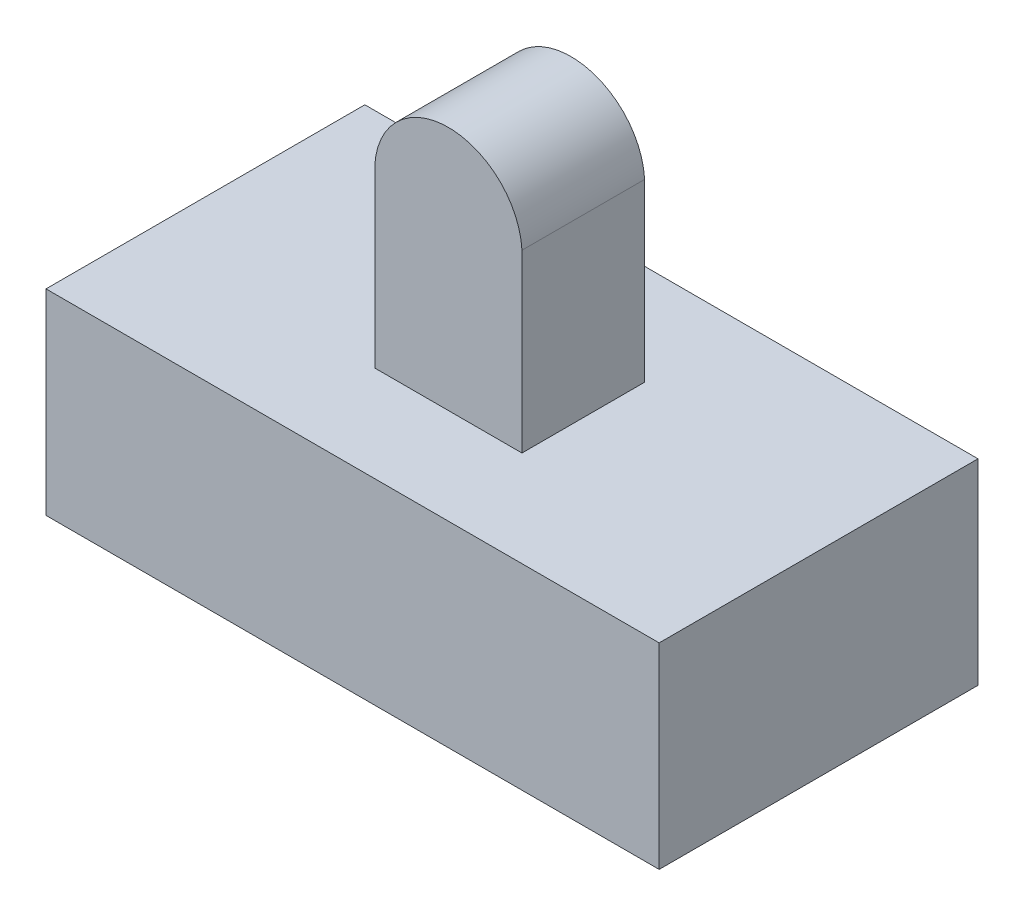
ISO-10303-21;
HEADER;
FILE_DESCRIPTION(('STEP AP214'),'2;1');
FILE_NAME('part.step','',(''),(''),'','','');
FILE_SCHEMA(('AUTOMOTIVE_DESIGN { 1 0 10303 214 1 1 1 1 }'));
ENDSEC;
DATA;
#1=APPLICATION_CONTEXT('core data for automotive mechanical design processes');
#2=APPLICATION_PROTOCOL_DEFINITION('international standard','automotive_design',2000,#1);
#3=PRODUCT_CONTEXT('',#1,'mechanical');
#4=PRODUCT('Part','Part','',(#3));
#5=PRODUCT_RELATED_PRODUCT_CATEGORY('part','',(#4));
#6=PRODUCT_DEFINITION_FORMATION('','',#4);
#7=PRODUCT_DEFINITION_CONTEXT('part definition',#1,'design');
#8=PRODUCT_DEFINITION('design','',#6,#7);
#9=PRODUCT_DEFINITION_SHAPE('','',#8);
#10=(LENGTH_UNIT() NAMED_UNIT(*) SI_UNIT(.MILLI.,.METRE.));
#11=(NAMED_UNIT(*) PLANE_ANGLE_UNIT() SI_UNIT($,.RADIAN.));
#12=(NAMED_UNIT(*) SI_UNIT($,.STERADIAN.) SOLID_ANGLE_UNIT());
#13=UNCERTAINTY_MEASURE_WITH_UNIT(LENGTH_MEASURE(1.E-05),#10,'distance_accuracy_value','');
#14=(GEOMETRIC_REPRESENTATION_CONTEXT(3) GLOBAL_UNCERTAINTY_ASSIGNED_CONTEXT((#13)) GLOBAL_UNIT_ASSIGNED_CONTEXT((#10,
#11,#12)) REPRESENTATION_CONTEXT('',''));
#15=CARTESIAN_POINT('',(0.,0.,0.));
#16=DIRECTION('',(0.,0.,1.));
#17=DIRECTION('',(1.,0.,0.));
#18=AXIS2_PLACEMENT_3D('',#15,#16,#17);
#19=CARTESIAN_POINT('',(9.67525773195877,18.,-0.59748188321778));
#20=DIRECTION('',(0.,0.,1.));
#21=DIRECTION('',(1.,0.,0.));
#22=AXIS2_PLACEMENT_3D('',#19,#20,#21);
#23=PLANE('',#22);
#24=CARTESIAN_POINT('',(6.67525773195877,14.9954138747722,-0.597481883217779));
#25=DIRECTION('',(0.,0.,-1.));
#26=DIRECTION('',(-1.,0.,0.));
#27=AXIS2_PLACEMENT_3D('',#24,#25,#26);
#28=CIRCLE('',#27,3.00458612522776);
#29=CARTESIAN_POINT('',(9.67525773195877,15.1613589979641,-0.59748188321778));
#30=VERTEX_POINT('',#29);
#31=CARTESIAN_POINT('',(3.67525773195877,15.1613589979641,-0.597481883217779));
#32=VERTEX_POINT('',#31);
#33=EDGE_CURVE('E150',#30,#32,#28,.F.);
#34=ORIENTED_EDGE('',*,*,#33,.F.);
#35=DIRECTION('',(0.,-1.,0.));
#36=VECTOR('',#35,1.);
#37=CARTESIAN_POINT('',(9.67525773195877,18.,-0.59748188321778));
#38=LINE('',#37,#36);
#39=CARTESIAN_POINT('',(9.67525773195877,8.,-0.59748188321778));
#40=VERTEX_POINT('',#39);
#41=EDGE_CURVE('E154',#30,#40,#38,.T.);
#42=ORIENTED_EDGE('',*,*,#41,.T.);
#43=DIRECTION('',(-1.,0.,0.));
#44=VECTOR('',#43,1.);
#45=CARTESIAN_POINT('',(9.67525773195877,8.,-0.59748188321778));
#46=LINE('',#45,#44);
#47=CARTESIAN_POINT('',(3.67525773195877,8.,-0.597481883217779));
#48=VERTEX_POINT('',#47);
#49=EDGE_CURVE('E431',#40,#48,#46,.T.);
#50=ORIENTED_EDGE('',*,*,#49,.T.);
#51=DIRECTION('',(0.,-1.,0.));
#52=VECTOR('',#51,1.);
#53=CARTESIAN_POINT('',(3.67525773195877,18.,-0.597481883217779));
#54=LINE('',#53,#52);
#55=EDGE_CURVE('E156',#32,#48,#54,.T.);
#56=ORIENTED_EDGE('',*,*,#55,.F.);
#57=EDGE_LOOP('',(#34,#42,#50,#56));
#58=FACE_BOUND('',#57,.T.);
#59=ADVANCED_FACE('F57',(#58),#23,.F.);
#60=CARTESIAN_POINT('',(9.67525773195877,18.,4.40251811678222));
#61=DIRECTION('',(0.,0.,-1.));
#62=DIRECTION('',(-1.,0.,0.));
#63=AXIS2_PLACEMENT_3D('',#60,#61,#62);
#64=PLANE('',#63);
#65=DIRECTION('',(0.,-1.,0.));
#66=VECTOR('',#65,1.);
#67=CARTESIAN_POINT('',(9.67525773195877,18.,4.40251811678222));
#68=LINE('',#67,#66);
#69=CARTESIAN_POINT('',(9.67525773195877,15.1613589979641,4.40251811678222));
#70=VERTEX_POINT('',#69);
#71=CARTESIAN_POINT('',(9.67525773195877,8.,4.40251811678222));
#72=VERTEX_POINT('',#71);
#73=EDGE_CURVE('E73',#70,#72,#68,.T.);
#74=ORIENTED_EDGE('',*,*,#73,.F.);
#75=CARTESIAN_POINT('',(6.67525773195877,14.9954138747722,4.40251811678222));
#76=DIRECTION('',(0.,0.,-1.));
#77=DIRECTION('',(-1.,0.,0.));
#78=AXIS2_PLACEMENT_3D('',#75,#76,#77);
#79=CIRCLE('',#78,3.00458612522776);
#80=CARTESIAN_POINT('',(3.67525773195877,15.1613589979641,4.40251811678222));
#81=VERTEX_POINT('',#80);
#82=EDGE_CURVE('E164',#70,#81,#79,.F.);
#83=ORIENTED_EDGE('',*,*,#82,.T.);
#84=DIRECTION('',(0.,-1.,0.));
#85=VECTOR('',#84,1.);
#86=CARTESIAN_POINT('',(3.67525773195877,18.,4.40251811678222));
#87=LINE('',#86,#85);
#88=CARTESIAN_POINT('',(3.67525773195877,8.,4.40251811678222));
#89=VERTEX_POINT('',#88);
#90=EDGE_CURVE('E81',#81,#89,#87,.T.);
#91=ORIENTED_EDGE('',*,*,#90,.T.);
#92=DIRECTION('',(1.,0.,0.));
#93=VECTOR('',#92,1.);
#94=CARTESIAN_POINT('',(9.67525773195877,8.,4.40251811678222));
#95=LINE('',#94,#93);
#96=EDGE_CURVE('E424',#89,#72,#95,.T.);
#97=ORIENTED_EDGE('',*,*,#96,.T.);
#98=EDGE_LOOP('',(#74,#83,#91,#97));
#99=FACE_BOUND('',#98,.T.);
#100=ADVANCED_FACE('F281',(#99),#64,.F.);
#101=CARTESIAN_POINT('',(-5.82474226804123,8.,-4.69072164948454));
#102=DIRECTION('',(1.,0.,0.));
#103=DIRECTION('',(0.,0.,-1.));
#104=AXIS2_PLACEMENT_3D('',#101,#102,#103);
#105=PLANE('',#104);
#106=DIRECTION('',(0.,0.,1.));
#107=VECTOR('',#106,1.);
#108=CARTESIAN_POINT('',(-5.82474226804123,0.,-4.69072164948454));
#109=LINE('',#108,#107);
#110=CARTESIAN_POINT('',(-5.82474226804123,0.,-4.69072164948454));
#111=VERTEX_POINT('',#110);
#112=CARTESIAN_POINT('',(-5.82474226804123,0.,8.30927835051546));
#113=VERTEX_POINT('',#112);
#114=EDGE_CURVE('E210',#111,#113,#109,.T.);
#115=ORIENTED_EDGE('',*,*,#114,.T.);
#116=DIRECTION('',(0.,-1.,0.));
#117=VECTOR('',#116,1.);
#118=CARTESIAN_POINT('',(-5.82474226804123,8.,8.30927835051546));
#119=LINE('',#118,#117);
#120=CARTESIAN_POINT('',(-5.82474226804123,8.,8.30927835051546));
#121=VERTEX_POINT('',#120);
#122=EDGE_CURVE('E12',#121,#113,#119,.T.);
#123=ORIENTED_EDGE('',*,*,#122,.F.);
#124=DIRECTION('',(0.,0.,1.));
#125=VECTOR('',#124,1.);
#126=CARTESIAN_POINT('',(-5.82474226804123,8.,-4.69072164948454));
#127=LINE('',#126,#125);
#128=CARTESIAN_POINT('',(-5.82474226804123,8.,-4.69072164948454));
#129=VERTEX_POINT('',#128);
#130=EDGE_CURVE('E220',#129,#121,#127,.T.);
#131=ORIENTED_EDGE('',*,*,#130,.F.);
#132=DIRECTION('',(0.,-1.,0.));
#133=VECTOR('',#132,1.);
#134=CARTESIAN_POINT('',(-5.82474226804123,8.,-4.69072164948454));
#135=LINE('',#134,#133);
#136=EDGE_CURVE('E234',#129,#111,#135,.T.);
#137=ORIENTED_EDGE('',*,*,#136,.T.);
#138=EDGE_LOOP('',(#115,#123,#131,#137));
#139=FACE_BOUND('',#138,.T.);
#140=ADVANCED_FACE('F59',(#139),#105,.F.);
#141=CARTESIAN_POINT('',(-5.82474226804123,8.,8.30927835051546));
#142=DIRECTION('',(0.,0.,-1.));
#143=DIRECTION('',(-1.,0.,0.));
#144=AXIS2_PLACEMENT_3D('',#141,#142,#143);
#145=PLANE('',#144);
#146=DIRECTION('',(1.,0.,0.));
#147=VECTOR('',#146,1.);
#148=CARTESIAN_POINT('',(-5.82474226804123,0.,8.30927835051546));
#149=LINE('',#148,#147);
#150=CARTESIAN_POINT('',(19.1752577319588,0.,8.30927835051546));
#151=VERTEX_POINT('',#150);
#152=EDGE_CURVE('E238',#113,#151,#149,.T.);
#153=ORIENTED_EDGE('',*,*,#152,.T.);
#154=DIRECTION('',(0.,-1.,0.));
#155=VECTOR('',#154,1.);
#156=CARTESIAN_POINT('',(19.1752577319588,8.,8.30927835051546));
#157=LINE('',#156,#155);
#158=CARTESIAN_POINT('',(19.1752577319588,8.,8.30927835051546));
#159=VERTEX_POINT('',#158);
#160=EDGE_CURVE('E66',#159,#151,#157,.T.);
#161=ORIENTED_EDGE('',*,*,#160,.F.);
#162=DIRECTION('',(1.,0.,0.));
#163=VECTOR('',#162,1.);
#164=CARTESIAN_POINT('',(-5.82474226804123,8.,8.30927835051546));
#165=LINE('',#164,#163);
#166=EDGE_CURVE('E224',#121,#159,#165,.T.);
#167=ORIENTED_EDGE('',*,*,#166,.F.);
#168=ORIENTED_EDGE('',*,*,#122,.T.);
#169=EDGE_LOOP('',(#153,#161,#167,#168));
#170=FACE_BOUND('',#169,.T.);
#171=ADVANCED_FACE('F274',(#170),#145,.F.);
#172=CARTESIAN_POINT('',(19.1752577319588,8.,-4.69072164948454));
#173=DIRECTION('',(-1.,0.,0.));
#174=DIRECTION('',(0.,0.,1.));
#175=AXIS2_PLACEMENT_3D('',#172,#173,#174);
#176=PLANE('',#175);
#177=DIRECTION('',(0.,0.,-1.));
#178=VECTOR('',#177,1.);
#179=CARTESIAN_POINT('',(19.1752577319588,0.,-4.69072164948454));
#180=LINE('',#179,#178);
#181=CARTESIAN_POINT('',(19.1752577319588,0.,-4.69072164948454));
#182=VERTEX_POINT('',#181);
#183=EDGE_CURVE('E241',#151,#182,#180,.T.);
#184=ORIENTED_EDGE('',*,*,#183,.T.);
#185=DIRECTION('',(0.,-1.,0.));
#186=VECTOR('',#185,1.);
#187=CARTESIAN_POINT('',(19.1752577319588,8.,-4.69072164948454));
#188=LINE('',#187,#186);
#189=CARTESIAN_POINT('',(19.1752577319588,8.,-4.69072164948454));
#190=VERTEX_POINT('',#189);
#191=EDGE_CURVE('E249',#190,#182,#188,.T.);
#192=ORIENTED_EDGE('',*,*,#191,.F.);
#193=DIRECTION('',(0.,0.,-1.));
#194=VECTOR('',#193,1.);
#195=CARTESIAN_POINT('',(19.1752577319588,8.,-4.69072164948454));
#196=LINE('',#195,#194);
#197=EDGE_CURVE('E228',#159,#190,#196,.T.);
#198=ORIENTED_EDGE('',*,*,#197,.F.);
#199=ORIENTED_EDGE('',*,*,#160,.T.);
#200=EDGE_LOOP('',(#184,#192,#198,#199));
#201=FACE_BOUND('',#200,.T.);
#202=ADVANCED_FACE('F258',(#201),#176,.F.);
#203=CARTESIAN_POINT('',(-5.82474226804123,8.,-4.69072164948454));
#204=DIRECTION('',(0.,0.,1.));
#205=DIRECTION('',(1.,0.,0.));
#206=AXIS2_PLACEMENT_3D('',#203,#204,#205);
#207=PLANE('',#206);
#208=DIRECTION('',(-1.,0.,0.));
#209=VECTOR('',#208,1.);
#210=CARTESIAN_POINT('',(-5.82474226804123,0.,-4.69072164948454));
#211=LINE('',#210,#209);
#212=EDGE_CURVE('E225',#182,#111,#211,.T.);
#213=ORIENTED_EDGE('',*,*,#212,.T.);
#214=ORIENTED_EDGE('',*,*,#136,.F.);
#215=DIRECTION('',(-1.,0.,0.));
#216=VECTOR('',#215,1.);
#217=CARTESIAN_POINT('',(-5.82474226804123,8.,-4.69072164948454));
#218=LINE('',#217,#216);
#219=EDGE_CURVE('E231',#190,#129,#218,.T.);
#220=ORIENTED_EDGE('',*,*,#219,.F.);
#221=ORIENTED_EDGE('',*,*,#191,.T.);
#222=EDGE_LOOP('',(#213,#214,#220,#221));
#223=FACE_BOUND('',#222,.T.);
#224=ADVANCED_FACE('F267',(#223),#207,.F.);
#225=CARTESIAN_POINT('',(0.,8.,0.));
#226=DIRECTION('',(0.,1.,0.));
#227=DIRECTION('',(0.,0.,1.));
#228=AXIS2_PLACEMENT_3D('',#225,#226,#227);
#229=PLANE('',#228);
#230=DIRECTION('',(0.,0.,-1.));
#231=VECTOR('',#230,1.);
#232=CARTESIAN_POINT('',(9.67525773195877,8.,-0.59748188321778));
#233=LINE('',#232,#231);
#234=EDGE_CURVE('E168',#72,#40,#233,.T.);
#235=ORIENTED_EDGE('',*,*,#234,.F.);
#236=ORIENTED_EDGE('',*,*,#96,.F.);
#237=DIRECTION('',(0.,0.,1.));
#238=VECTOR('',#237,1.);
#239=CARTESIAN_POINT('',(3.67525773195877,8.,-0.597481883217779));
#240=LINE('',#239,#238);
#241=EDGE_CURVE('E421',#48,#89,#240,.T.);
#242=ORIENTED_EDGE('',*,*,#241,.F.);
#243=ORIENTED_EDGE('',*,*,#49,.F.);
#244=EDGE_LOOP('',(#235,#236,#242,#243));
#245=FACE_BOUND('',#244,.T.);
#246=ORIENTED_EDGE('',*,*,#130,.T.);
#247=ORIENTED_EDGE('',*,*,#166,.T.);
#248=ORIENTED_EDGE('',*,*,#197,.T.);
#249=ORIENTED_EDGE('',*,*,#219,.T.);
#250=EDGE_LOOP('',(#246,#247,#248,#249));
#251=FACE_BOUND('',#250,.T.);
#252=ADVANCED_FACE('F273',(#245,#251),#229,.T.);
#253=CARTESIAN_POINT('',(0.,0.,0.));
#254=DIRECTION('',(0.,1.,0.));
#255=DIRECTION('',(0.,0.,1.));
#256=AXIS2_PLACEMENT_3D('',#253,#254,#255);
#257=PLANE('',#256);
#258=DIRECTION('',(-1.,0.,0.));
#259=VECTOR('',#258,1.);
#260=CARTESIAN_POINT('',(9.56866620461461,0.,4.20202605651723));
#261=LINE('',#260,#259);
#262=CARTESIAN_POINT('',(9.56866620461461,0.,4.20202605651723));
#263=VERTEX_POINT('',#262);
#264=CARTESIAN_POINT('',(3.56866620461461,0.,4.20202605651722));
#265=VERTEX_POINT('',#264);
#266=EDGE_CURVE('E174',#263,#265,#261,.T.);
#267=ORIENTED_EDGE('',*,*,#266,.F.);
#268=DIRECTION('',(0.,0.,1.));
#269=VECTOR('',#268,1.);
#270=CARTESIAN_POINT('',(9.56866620461461,0.,4.20202605651723));
#271=LINE('',#270,#269);
#272=CARTESIAN_POINT('',(9.56866620461461,0.,0.0020260565172243));
#273=VERTEX_POINT('',#272);
#274=EDGE_CURVE('E170',#273,#263,#271,.T.);
#275=ORIENTED_EDGE('',*,*,#274,.F.);
#276=DIRECTION('',(1.,0.,0.));
#277=VECTOR('',#276,1.);
#278=CARTESIAN_POINT('',(9.56866620461461,0.,0.0020260565172243));
#279=LINE('',#278,#277);
#280=CARTESIAN_POINT('',(3.56866620461461,0.,0.00202605651722408));
#281=VERTEX_POINT('',#280);
#282=EDGE_CURVE('E184',#281,#273,#279,.T.);
#283=ORIENTED_EDGE('',*,*,#282,.F.);
#284=DIRECTION('',(0.,0.,-1.));
#285=VECTOR('',#284,1.);
#286=CARTESIAN_POINT('',(3.56866620461461,0.,4.20202605651722));
#287=LINE('',#286,#285);
#288=EDGE_CURVE('E200',#265,#281,#287,.T.);
#289=ORIENTED_EDGE('',*,*,#288,.F.);
#290=EDGE_LOOP('',(#267,#275,#283,#289));
#291=FACE_BOUND('',#290,.T.);
#292=ORIENTED_EDGE('',*,*,#114,.F.);
#293=ORIENTED_EDGE('',*,*,#212,.F.);
#294=ORIENTED_EDGE('',*,*,#183,.F.);
#295=ORIENTED_EDGE('',*,*,#152,.F.);
#296=EDGE_LOOP('',(#292,#293,#294,#295));
#297=FACE_BOUND('',#296,.T.);
#298=ADVANCED_FACE('F264',(#291,#297),#257,.F.);
#299=CARTESIAN_POINT('',(9.56866620461461,7.,4.20202605651723));
#300=DIRECTION('',(1.,0.,0.));
#301=DIRECTION('',(0.,0.,-1.));
#302=AXIS2_PLACEMENT_3D('',#299,#300,#301);
#303=PLANE('',#302);
#304=ORIENTED_EDGE('',*,*,#274,.T.);
#305=DIRECTION('',(0.,-1.,0.));
#306=VECTOR('',#305,1.);
#307=CARTESIAN_POINT('',(9.56866620461461,7.,4.20202605651723));
#308=LINE('',#307,#306);
#309=CARTESIAN_POINT('',(9.56866620461461,7.,4.20202605651723));
#310=VERTEX_POINT('',#309);
#311=EDGE_CURVE('E195',#310,#263,#308,.T.);
#312=ORIENTED_EDGE('',*,*,#311,.F.);
#313=DIRECTION('',(0.,0.,1.));
#314=VECTOR('',#313,1.);
#315=CARTESIAN_POINT('',(9.56866620461461,7.,4.20202605651723));
#316=LINE('',#315,#314);
#317=CARTESIAN_POINT('',(9.56866620461461,7.,0.0020260565172243));
#318=VERTEX_POINT('',#317);
#319=EDGE_CURVE('E179',#318,#310,#316,.T.);
#320=ORIENTED_EDGE('',*,*,#319,.F.);
#321=DIRECTION('',(0.,-1.,0.));
#322=VECTOR('',#321,1.);
#323=CARTESIAN_POINT('',(9.56866620461461,7.,0.0020260565172243));
#324=LINE('',#323,#322);
#325=EDGE_CURVE('E207',#318,#273,#324,.T.);
#326=ORIENTED_EDGE('',*,*,#325,.T.);
#327=EDGE_LOOP('',(#304,#312,#320,#326));
#328=FACE_BOUND('',#327,.T.);
#329=ADVANCED_FACE('F302',(#328),#303,.F.);
#330=CARTESIAN_POINT('',(9.56866620461461,7.,0.0020260565172243));
#331=DIRECTION('',(0.,0.,-1.));
#332=DIRECTION('',(-1.,0.,0.));
#333=AXIS2_PLACEMENT_3D('',#330,#331,#332);
#334=PLANE('',#333);
#335=ORIENTED_EDGE('',*,*,#282,.T.);
#336=ORIENTED_EDGE('',*,*,#325,.F.);
#337=DIRECTION('',(1.,0.,0.));
#338=VECTOR('',#337,1.);
#339=CARTESIAN_POINT('',(9.56866620461461,7.,0.0020260565172243));
#340=LINE('',#339,#338);
#341=CARTESIAN_POINT('',(3.56866620461461,7.,0.00202605651722408));
#342=VERTEX_POINT('',#341);
#343=EDGE_CURVE('E192',#342,#318,#340,.T.);
#344=ORIENTED_EDGE('',*,*,#343,.F.);
#345=DIRECTION('',(0.,-1.,0.));
#346=VECTOR('',#345,1.);
#347=CARTESIAN_POINT('',(3.56866620461461,7.,0.00202605651722408));
#348=LINE('',#347,#346);
#349=EDGE_CURVE('E211',#342,#281,#348,.T.);
#350=ORIENTED_EDGE('',*,*,#349,.T.);
#351=EDGE_LOOP('',(#335,#336,#344,#350));
#352=FACE_BOUND('',#351,.T.);
#353=ADVANCED_FACE('F298',(#352),#334,.F.);
#354=CARTESIAN_POINT('',(3.56866620461461,7.,4.20202605651722));
#355=DIRECTION('',(-1.,0.,0.));
#356=DIRECTION('',(0.,0.,1.));
#357=AXIS2_PLACEMENT_3D('',#354,#355,#356);
#358=PLANE('',#357);
#359=ORIENTED_EDGE('',*,*,#288,.T.);
#360=ORIENTED_EDGE('',*,*,#349,.F.);
#361=DIRECTION('',(0.,0.,-1.));
#362=VECTOR('',#361,1.);
#363=CARTESIAN_POINT('',(3.56866620461461,7.,4.20202605651722));
#364=LINE('',#363,#362);
#365=CARTESIAN_POINT('',(3.56866620461461,7.,4.20202605651722));
#366=VERTEX_POINT('',#365);
#367=EDGE_CURVE('E188',#366,#342,#364,.T.);
#368=ORIENTED_EDGE('',*,*,#367,.F.);
#369=DIRECTION('',(0.,-1.,0.));
#370=VECTOR('',#369,1.);
#371=CARTESIAN_POINT('',(3.56866620461461,7.,4.20202605651722));
#372=LINE('',#371,#370);
#373=EDGE_CURVE('E214',#366,#265,#372,.T.);
#374=ORIENTED_EDGE('',*,*,#373,.T.);
#375=EDGE_LOOP('',(#359,#360,#368,#374));
#376=FACE_BOUND('',#375,.T.);
#377=ADVANCED_FACE('F301',(#376),#358,.F.);
#378=CARTESIAN_POINT('',(9.56866620461461,7.,4.20202605651723));
#379=DIRECTION('',(0.,0.,1.));
#380=DIRECTION('',(1.,0.,0.));
#381=AXIS2_PLACEMENT_3D('',#378,#379,#380);
#382=PLANE('',#381);
#383=ORIENTED_EDGE('',*,*,#266,.T.);
#384=ORIENTED_EDGE('',*,*,#373,.F.);
#385=DIRECTION('',(-1.,0.,0.));
#386=VECTOR('',#385,1.);
#387=CARTESIAN_POINT('',(9.56866620461461,7.,4.20202605651723));
#388=LINE('',#387,#386);
#389=EDGE_CURVE('E183',#310,#366,#388,.T.);
#390=ORIENTED_EDGE('',*,*,#389,.F.);
#391=ORIENTED_EDGE('',*,*,#311,.T.);
#392=EDGE_LOOP('',(#383,#384,#390,#391));
#393=FACE_BOUND('',#392,.T.);
#394=ADVANCED_FACE('F296',(#393),#382,.F.);
#395=CARTESIAN_POINT('',(0.,7.,0.));
#396=DIRECTION('',(0.,1.,0.));
#397=DIRECTION('',(0.,0.,1.));
#398=AXIS2_PLACEMENT_3D('',#395,#396,#397);
#399=PLANE('',#398);
#400=ORIENTED_EDGE('',*,*,#319,.T.);
#401=ORIENTED_EDGE('',*,*,#389,.T.);
#402=ORIENTED_EDGE('',*,*,#367,.T.);
#403=ORIENTED_EDGE('',*,*,#343,.T.);
#404=EDGE_LOOP('',(#400,#401,#402,#403));
#405=FACE_BOUND('',#404,.T.);
#406=ADVANCED_FACE('F293',(#405),#399,.F.);
#407=CARTESIAN_POINT('',(9.67525773195877,18.,-0.59748188321778));
#408=DIRECTION('',(-1.,0.,0.));
#409=DIRECTION('',(0.,0.,1.));
#410=AXIS2_PLACEMENT_3D('',#407,#408,#409);
#411=PLANE('',#410);
#412=ORIENTED_EDGE('',*,*,#41,.F.);
#413=DIRECTION('',(0.,0.,-1.));
#414=VECTOR('',#413,1.);
#415=CARTESIAN_POINT('',(9.67525773195877,15.1613589979641,9.40251811678222));
#416=LINE('',#415,#414);
#417=EDGE_CURVE('E161',#70,#30,#416,.T.);
#418=ORIENTED_EDGE('',*,*,#417,.F.);
#419=ORIENTED_EDGE('',*,*,#73,.T.);
#420=ORIENTED_EDGE('',*,*,#234,.T.);
#421=EDGE_LOOP('',(#412,#418,#419,#420));
#422=FACE_BOUND('',#421,.T.);
#423=ADVANCED_FACE('F167',(#422),#411,.F.);
#424=CARTESIAN_POINT('',(3.67525773195877,18.,-0.597481883217779));
#425=DIRECTION('',(1.,0.,0.));
#426=DIRECTION('',(0.,0.,-1.));
#427=AXIS2_PLACEMENT_3D('',#424,#425,#426);
#428=PLANE('',#427);
#429=ORIENTED_EDGE('',*,*,#90,.F.);
#430=DIRECTION('',(0.,0.,-1.));
#431=VECTOR('',#430,1.);
#432=CARTESIAN_POINT('',(3.67525773195877,15.1613589979641,9.40251811678222));
#433=LINE('',#432,#431);
#434=EDGE_CURVE('E160',#81,#32,#433,.T.);
#435=ORIENTED_EDGE('',*,*,#434,.T.);
#436=ORIENTED_EDGE('',*,*,#55,.T.);
#437=ORIENTED_EDGE('',*,*,#241,.T.);
#438=EDGE_LOOP('',(#429,#435,#436,#437));
#439=FACE_BOUND('',#438,.T.);
#440=ADVANCED_FACE('F290',(#439),#428,.F.);
#441=CARTESIAN_POINT('',(6.67525773195877,14.9954138747722,9.40251811678222));
#442=DIRECTION('',(0.,0.,-1.));
#443=DIRECTION('',(-1.,0.,0.));
#444=AXIS2_PLACEMENT_3D('',#441,#442,#443);
#445=CYLINDRICAL_SURFACE('',#444,3.00458612522776);
#446=ORIENTED_EDGE('',*,*,#82,.F.);
#447=ORIENTED_EDGE('',*,*,#417,.T.);
#448=ORIENTED_EDGE('',*,*,#33,.T.);
#449=ORIENTED_EDGE('',*,*,#434,.F.);
#450=EDGE_LOOP('',(#446,#447,#448,#449));
#451=FACE_BOUND('',#450,.T.);
#452=ADVANCED_FACE('F163',(#451),#445,.T.);
#453=CLOSED_SHELL('',(#59,#100,#140,#171,#202,#224,#252,#298,#329,#353,#377,#394,#406,#423,#440,#452));
#454=MANIFOLD_SOLID_BREP('B2',#453);
#455=ADVANCED_BREP_SHAPE_REPRESENTATION('',(#18,#454),#14);
#456=SHAPE_DEFINITION_REPRESENTATION(#9,#455);
ENDSEC;
END-ISO-10303-21;
